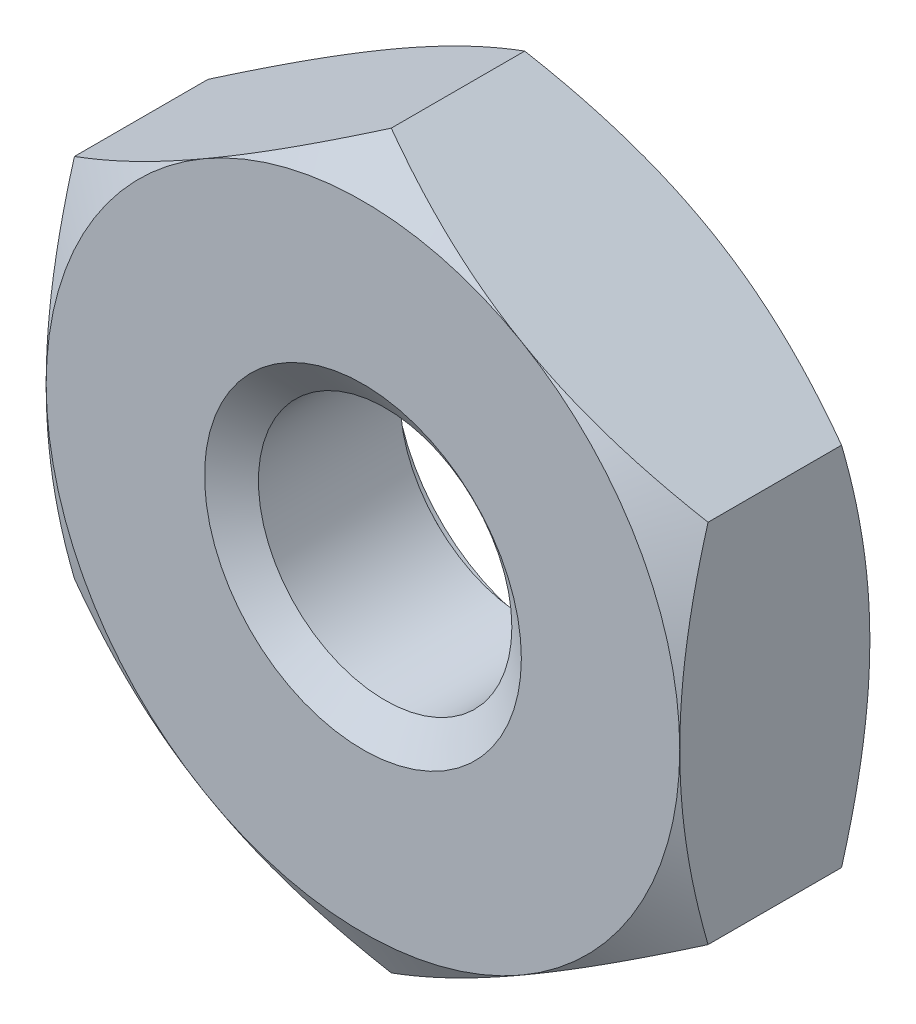
ISO-10303-21;
HEADER;
FILE_DESCRIPTION(('STEP AP214'),'2;1');
FILE_NAME('part.step','',(''),(''),'','','');
FILE_SCHEMA(('AUTOMOTIVE_DESIGN { 1 0 10303 214 1 1 1 1 }'));
ENDSEC;
DATA;
#1=APPLICATION_CONTEXT('core data for automotive mechanical design processes');
#2=APPLICATION_PROTOCOL_DEFINITION('international standard','automotive_design',2000,#1);
#3=PRODUCT_CONTEXT('',#1,'mechanical');
#4=PRODUCT('Part','Part','',(#3));
#5=PRODUCT_RELATED_PRODUCT_CATEGORY('part','',(#4));
#6=PRODUCT_DEFINITION_FORMATION('','',#4);
#7=PRODUCT_DEFINITION_CONTEXT('part definition',#1,'design');
#8=PRODUCT_DEFINITION('design','',#6,#7);
#9=PRODUCT_DEFINITION_SHAPE('','',#8);
#10=(LENGTH_UNIT() NAMED_UNIT(*) SI_UNIT(.MILLI.,.METRE.));
#11=(NAMED_UNIT(*) PLANE_ANGLE_UNIT() SI_UNIT($,.RADIAN.));
#12=(NAMED_UNIT(*) SI_UNIT($,.STERADIAN.) SOLID_ANGLE_UNIT());
#13=UNCERTAINTY_MEASURE_WITH_UNIT(LENGTH_MEASURE(1.E-05),#10,'distance_accuracy_value','');
#14=(GEOMETRIC_REPRESENTATION_CONTEXT(3) GLOBAL_UNCERTAINTY_ASSIGNED_CONTEXT((#13)) GLOBAL_UNIT_ASSIGNED_CONTEXT((#10,
#11,#12)) REPRESENTATION_CONTEXT('',''));
#15=CARTESIAN_POINT('',(0.,0.,0.));
#16=DIRECTION('',(0.,0.,1.));
#17=DIRECTION('',(1.,0.,0.));
#18=AXIS2_PLACEMENT_3D('',#15,#16,#17);
#19=CARTESIAN_POINT('',(0.,0.,-1.2));
#20=DIRECTION('',(0.,0.,1.));
#21=DIRECTION('',(1.,0.,0.));
#22=AXIS2_PLACEMENT_3D('',#19,#20,#21);
#23=CYLINDRICAL_SURFACE('',#22,0.8);
#24=CARTESIAN_POINT('',(0.,0.,-0.140041507641943));
#25=DIRECTION('',(0.,0.,1.));
#26=DIRECTION('',(1.,0.,0.));
#27=AXIS2_PLACEMENT_3D('',#24,#25,#26);
#28=CIRCLE('',#27,0.8);
#29=CARTESIAN_POINT('',(0.8,0.,-0.140041507641943));
#30=VERTEX_POINT('',#29);
#31=EDGE_CURVE('E175',#30,#30,#28,.F.);
#32=ORIENTED_EDGE('',*,*,#31,.F.);
#33=EDGE_LOOP('',(#32));
#34=FACE_BOUND('',#33,.T.);
#35=CARTESIAN_POINT('',(0.,0.,-1.03455849235806));
#36=DIRECTION('',(0.,0.,-1.));
#37=DIRECTION('',(-1.,0.,0.));
#38=AXIS2_PLACEMENT_3D('',#35,#36,#37);
#39=CIRCLE('',#38,0.8);
#40=CARTESIAN_POINT('',(-0.8,0.,-1.03455849235806));
#41=VERTEX_POINT('',#40);
#42=EDGE_CURVE('E40',#41,#41,#39,.F.);
#43=ORIENTED_EDGE('',*,*,#42,.F.);
#44=EDGE_LOOP('',(#43));
#45=FACE_BOUND('',#44,.T.);
#46=ADVANCED_FACE('F35',(#34,#45),#23,.F.);
#47=CARTESIAN_POINT('',(0.,2.3094010767585,-1.2));
#48=DIRECTION('',(-0.5,0.866025403784438,0.));
#49=DIRECTION('',(-0.866025403784438,-0.500000000000001,0.));
#50=AXIS2_PLACEMENT_3D('',#47,#48,#49);
#51=PLANE('',#50);
#52=DIRECTION('',(0.,0.,1.));
#53=VECTOR('',#52,1.);
#54=CARTESIAN_POINT('',(-2.,1.15470053837925,-1.2));
#55=LINE('',#54,#53);
#56=CARTESIAN_POINT('',(-2.,1.15470053837925,-1.02136720504592));
#57=VERTEX_POINT('',#56);
#58=CARTESIAN_POINT('',(-2.,1.15470053837925,-0.178632794954082));
#59=VERTEX_POINT('',#58);
#60=EDGE_CURVE('E165',#57,#59,#55,.T.);
#61=ORIENTED_EDGE('',*,*,#60,.T.);
#62=CARTESIAN_POINT('',(-2.0002,1.15458506832541,-0.178699466620499));
#63=CARTESIAN_POINT('',(-1.91230873709994,1.20532911262018,-0.14938953610068));
#64=CARTESIAN_POINT('',(-1.82365880552641,1.2565111744778,-0.122732851980468));
#65=CARTESIAN_POINT('',(-1.6448237530022,1.35976164019319,-0.0762024910207216));
#66=CARTESIAN_POINT('',(-1.55463545349496,1.41183187919145,-0.0563452763827796));
#67=CARTESIAN_POINT('',(-1.37537661423669,1.51532701829183,-0.0254334640232529));
#68=CARTESIAN_POINT('',(-1.2863336617737,1.56673599086578,-0.0141731515985315));
#69=CARTESIAN_POINT('',(-1.10782860221496,1.66979593505373,-0.000728662594642205));
#70=CARTESIAN_POINT('',(-1.01836714429604,1.72144653186531,0.00146664504653155));
#71=CARTESIAN_POINT('',(-0.851191646451202,1.81796535054794,-0.00309098933064922));
#72=CARTESIAN_POINT('',(-0.773452629734216,1.86284799277603,-0.00872487468701521));
#73=CARTESIAN_POINT('',(-0.618481085463867,1.95232085557725,-0.0265838952608293));
#74=CARTESIAN_POINT('',(-0.541249094258801,1.99691076648954,-0.0388151360234403));
#75=CARTESIAN_POINT('',(-0.385957813517799,2.08656822922816,-0.069393436867611));
#76=CARTESIAN_POINT('',(-0.30791818689262,2.13162442866767,-0.0878701670657172));
#77=CARTESIAN_POINT('',(-0.153003134307865,2.221064675979,-0.129805518212858));
#78=CARTESIAN_POINT('',(-0.0761257223768793,2.26544987045196,-0.153254280492316));
#79=CARTESIAN_POINT('',(0.000200000000000681,2.30951654681234,-0.1786994666205));
#80=B_SPLINE_CURVE_WITH_KNOTS('',3,(#62,#63,#64,#65,#66,#67,#68,#69,#70,#71,#72,#73,#74,#75,#76,
#77,#78,#79),.UNSPECIFIED.,.F.,.F.,(4,2,2,2,2,2,2,2,4),(0.,0.31703182469561,0.634825876346564,
0.944753967652636,1.25430138000371,1.52387047293094,1.79368946861028,2.06949491027634,
2.34475850821473),.UNSPECIFIED.);
#81=CARTESIAN_POINT('',(-1.,1.73205080756888,0.));
#82=VERTEX_POINT('',#81);
#83=EDGE_CURVE('E134',#59,#82,#80,.T.);
#84=ORIENTED_EDGE('',*,*,#83,.T.);
#85=CARTESIAN_POINT('',(0.,2.3094010767585,-0.178632794954083));
#86=VERTEX_POINT('',#85);
#87=EDGE_CURVE('E54',#82,#86,#80,.T.);
#88=ORIENTED_EDGE('',*,*,#87,.T.);
#89=DIRECTION('',(0.,0.,1.));
#90=VECTOR('',#89,1.);
#91=CARTESIAN_POINT('',(0.,2.3094010767585,-1.2));
#92=LINE('',#91,#90);
#93=CARTESIAN_POINT('',(0.,2.3094010767585,-1.02136720504592));
#94=VERTEX_POINT('',#93);
#95=EDGE_CURVE('E150',#94,#86,#92,.T.);
#96=ORIENTED_EDGE('',*,*,#95,.F.);
#97=CARTESIAN_POINT('',(-2.0002,1.15458506832541,-1.0213005333795));
#98=CARTESIAN_POINT('',(-1.91230873709994,1.20532911262018,-1.05061046389932));
#99=CARTESIAN_POINT('',(-1.82365880552641,1.2565111744778,-1.07726714801953));
#100=CARTESIAN_POINT('',(-1.6448237530022,1.35976164019319,-1.12379750897928));
#101=CARTESIAN_POINT('',(-1.55463545349496,1.41183187919145,-1.14365472361722));
#102=CARTESIAN_POINT('',(-1.37537661423669,1.51532701829183,-1.17456653597675));
#103=CARTESIAN_POINT('',(-1.2863336617737,1.56673599086578,-1.18582684840147));
#104=CARTESIAN_POINT('',(-1.10782860221496,1.66979593505373,-1.19927133740536));
#105=CARTESIAN_POINT('',(-1.01836714429604,1.72144653186531,-1.20146664504653));
#106=CARTESIAN_POINT('',(-0.851191646451202,1.81796535054794,-1.19690901066935));
#107=CARTESIAN_POINT('',(-0.773452629734216,1.86284799277603,-1.19127512531298));
#108=CARTESIAN_POINT('',(-0.618481085463866,1.95232085557725,-1.17341610473917));
#109=CARTESIAN_POINT('',(-0.541249094258801,1.99691076648954,-1.16118486397656));
#110=CARTESIAN_POINT('',(-0.385957813517799,2.08656822922816,-1.13060656313239));
#111=CARTESIAN_POINT('',(-0.30791818689262,2.13162442866767,-1.11212983293428));
#112=CARTESIAN_POINT('',(-0.153003134307865,2.221064675979,-1.07019448178714));
#113=CARTESIAN_POINT('',(-0.0761257223768793,2.26544987045196,-1.04674571950768));
#114=CARTESIAN_POINT('',(0.000200000000000687,2.30951654681234,-1.0213005333795));
#115=B_SPLINE_CURVE_WITH_KNOTS('',3,(#97,#98,#99,#100,#101,#102,#103,#104,#105,#106,#107,#108,
#109,#110,#111,#112,#113,#114),.UNSPECIFIED.,.F.,.F.,(4,2,2,2,2,2,2,2,4),(0.,0.31703182469561,
0.634825876346564,0.944753967652636,1.25430138000371,1.52387047293094,1.79368946861028,
2.06949491027634,2.34475850821473),.UNSPECIFIED.);
#116=CARTESIAN_POINT('',(-1.,1.73205080756888,-1.2));
#117=VERTEX_POINT('',#116);
#118=EDGE_CURVE('E168',#117,#94,#115,.T.);
#119=ORIENTED_EDGE('',*,*,#118,.F.);
#120=EDGE_CURVE('E267',#57,#117,#115,.T.);
#121=ORIENTED_EDGE('',*,*,#120,.F.);
#122=EDGE_LOOP('',(#61,#84,#88,#96,#119,#121));
#123=FACE_BOUND('',#122,.T.);
#124=ADVANCED_FACE('F37',(#123),#51,.T.);
#125=CARTESIAN_POINT('',(2.,1.15470053837925,-1.2));
#126=DIRECTION('',(0.500000000000001,0.866025403784438,0.));
#127=DIRECTION('',(-0.866025403784438,0.500000000000001,0.));
#128=AXIS2_PLACEMENT_3D('',#125,#126,#127);
#129=PLANE('',#128);
#130=ORIENTED_EDGE('',*,*,#95,.T.);
#131=CARTESIAN_POINT('',(-0.000199999999999642,2.30951654681234,-0.1786994666205));
#132=CARTESIAN_POINT('',(0.0876912629000606,2.25877250251758,-0.149389536100681));
#133=CARTESIAN_POINT('',(0.176341194473592,2.20759044065996,-0.122732851980469));
#134=CARTESIAN_POINT('',(0.355176246997803,2.10433997494456,-0.0762024910207223));
#135=CARTESIAN_POINT('',(0.445364546505037,2.05226973594631,-0.05634527638278));
#136=CARTESIAN_POINT('',(0.624623385763307,1.94877459684592,-0.025433464023253));
#137=CARTESIAN_POINT('',(0.713666338226305,1.89736562427197,-0.0141731515985316));
#138=CARTESIAN_POINT('',(0.892171397785044,1.79430568008402,-0.000728662594642256));
#139=CARTESIAN_POINT('',(0.981632855703959,1.74265508327244,0.00146664504653147));
#140=CARTESIAN_POINT('',(1.1488083535488,1.64613626458981,-0.00309098933064909));
#141=CARTESIAN_POINT('',(1.22654737026578,1.60125362236172,-0.00872487468701486));
#142=CARTESIAN_POINT('',(1.38151891453613,1.51178075956051,-0.0265838952608287));
#143=CARTESIAN_POINT('',(1.4587509057412,1.46719084864821,-0.0388151360234397));
#144=CARTESIAN_POINT('',(1.6140421864822,1.37753338590959,-0.0693934368676103));
#145=CARTESIAN_POINT('',(1.69208181310738,1.33247718647009,-0.0878701670657164));
#146=CARTESIAN_POINT('',(1.84699686569213,1.24303693915875,-0.129805518212856));
#147=CARTESIAN_POINT('',(1.92387427762312,1.1986517446858,-0.153254280492314));
#148=CARTESIAN_POINT('',(2.0002,1.15458506832541,-0.178699466620499));
#149=B_SPLINE_CURVE_WITH_KNOTS('',3,(#131,#132,#133,#134,#135,#136,#137,#138,#139,#140,#141,
#142,#143,#144,#145,#146,#147,#148),.UNSPECIFIED.,.F.,.F.,(4,2,2,2,2,2,2,2,4),(0.,
0.31703182469561,0.634825876346564,0.944753967652637,1.25430138000371,1.52387047293094,
1.79368946861028,2.06949491027634,2.34475850821472),.UNSPECIFIED.);
#150=CARTESIAN_POINT('',(1.,1.73205080756888,0.));
#151=VERTEX_POINT('',#150);
#152=EDGE_CURVE('E144',#86,#151,#149,.T.);
#153=ORIENTED_EDGE('',*,*,#152,.T.);
#154=CARTESIAN_POINT('',(2.,1.15470053837925,-0.178632794954083));
#155=VERTEX_POINT('',#154);
#156=EDGE_CURVE('E61',#151,#155,#149,.T.);
#157=ORIENTED_EDGE('',*,*,#156,.T.);
#158=DIRECTION('',(0.,0.,1.));
#159=VECTOR('',#158,1.);
#160=CARTESIAN_POINT('',(2.,1.15470053837925,-1.2));
#161=LINE('',#160,#159);
#162=CARTESIAN_POINT('',(2.,1.15470053837925,-1.02136720504592));
#163=VERTEX_POINT('',#162);
#164=EDGE_CURVE('E143',#163,#155,#161,.T.);
#165=ORIENTED_EDGE('',*,*,#164,.F.);
#166=CARTESIAN_POINT('',(-0.000199999999999642,2.30951654681234,-1.0213005333795));
#167=CARTESIAN_POINT('',(0.0876912629000602,2.25877250251758,-1.05061046389932));
#168=CARTESIAN_POINT('',(0.176341194473592,2.20759044065996,-1.07726714801953));
#169=CARTESIAN_POINT('',(0.355176246997803,2.10433997494456,-1.12379750897928));
#170=CARTESIAN_POINT('',(0.445364546505037,2.05226973594631,-1.14365472361722));
#171=CARTESIAN_POINT('',(0.624623385763307,1.94877459684592,-1.17456653597675));
#172=CARTESIAN_POINT('',(0.713666338226305,1.89736562427197,-1.18582684840147));
#173=CARTESIAN_POINT('',(0.892171397785044,1.79430568008402,-1.19927133740536));
#174=CARTESIAN_POINT('',(0.981632855703959,1.74265508327244,-1.20146664504653));
#175=CARTESIAN_POINT('',(1.1488083535488,1.64613626458981,-1.19690901066935));
#176=CARTESIAN_POINT('',(1.22654737026578,1.60125362236172,-1.19127512531298));
#177=CARTESIAN_POINT('',(1.38151891453613,1.51178075956051,-1.17341610473917));
#178=CARTESIAN_POINT('',(1.4587509057412,1.46719084864821,-1.16118486397656));
#179=CARTESIAN_POINT('',(1.6140421864822,1.37753338590959,-1.13060656313239));
#180=CARTESIAN_POINT('',(1.69208181310738,1.33247718647009,-1.11212983293428));
#181=CARTESIAN_POINT('',(1.84699686569213,1.24303693915875,-1.07019448178714));
#182=CARTESIAN_POINT('',(1.92387427762312,1.1986517446858,-1.04674571950769));
#183=CARTESIAN_POINT('',(2.0002,1.15458506832541,-1.0213005333795));
#184=B_SPLINE_CURVE_WITH_KNOTS('',3,(#166,#167,#168,#169,#170,#171,#172,#173,#174,#175,#176,
#177,#178,#179,#180,#181,#182,#183),.UNSPECIFIED.,.F.,.F.,(4,2,2,2,2,2,2,2,4),(0.,
0.317031824695611,0.634825876346565,0.944753967652637,1.25430138000371,1.52387047293094,
1.79368946861028,2.06949491027634,2.34475850821473),.UNSPECIFIED.);
#185=CARTESIAN_POINT('',(1.,1.73205080756888,-1.2));
#186=VERTEX_POINT('',#185);
#187=EDGE_CURVE('E260',#186,#163,#184,.T.);
#188=ORIENTED_EDGE('',*,*,#187,.F.);
#189=EDGE_CURVE('E266',#94,#186,#184,.T.);
#190=ORIENTED_EDGE('',*,*,#189,.F.);
#191=EDGE_LOOP('',(#130,#153,#157,#165,#188,#190));
#192=FACE_BOUND('',#191,.T.);
#193=ADVANCED_FACE('F141',(#192),#129,.T.);
#194=CARTESIAN_POINT('',(2.,1.15470053837925,-1.2));
#195=DIRECTION('',(-1.,0.,0.));
#196=DIRECTION('',(0.,0.,1.));
#197=AXIS2_PLACEMENT_3D('',#194,#195,#196);
#198=PLANE('',#197);
#199=CARTESIAN_POINT('',(2.,-3.06243599497946,-0.957053410620322));
#200=CARTESIAN_POINT('',(2.,-2.97462468513202,-0.914618135332453));
#201=CARTESIAN_POINT('',(2.,-2.88660576044574,-0.872604701878199));
#202=CARTESIAN_POINT('',(2.,-2.71004042392046,-0.789662573424089));
#203=CARTESIAN_POINT('',(2.,-2.62149392396102,-0.748734066234633));
#204=CARTESIAN_POINT('',(2.,-2.44328285836993,-0.667987231477972));
#205=CARTESIAN_POINT('',(2.,-2.3536147942302,-0.628176597351501));
#206=CARTESIAN_POINT('',(2.,-2.17354167395292,-0.55026529289016));
#207=CARTESIAN_POINT('',(2.,-2.08313665652235,-0.512164533422732));
#208=CARTESIAN_POINT('',(2.,-1.90031404940485,-0.437671460362099));
#209=CARTESIAN_POINT('',(2.,-1.80788540023433,-0.401306140224328));
#210=CARTESIAN_POINT('',(2.,-1.62195694964761,-0.331431205515075));
#211=CARTESIAN_POINT('',(2.,-1.52845725096658,-0.297921319609402));
#212=CARTESIAN_POINT('',(2.,-1.34040158791134,-0.234645877627143));
#213=CARTESIAN_POINT('',(2.,-1.24584820361334,-0.204872731943686));
#214=CARTESIAN_POINT('',(2.,-1.05539728812543,-0.150041663725098));
#215=CARTESIAN_POINT('',(2.,-0.959500192348563,-0.124982250068513));
#216=CARTESIAN_POINT('',(2.,-0.766296107056175,-0.0807954522614518));
#217=CARTESIAN_POINT('',(2.,-0.668988749343052,-0.0616696475902393));
#218=CARTESIAN_POINT('',(2.,-0.47320157375166,-0.0306369133490218));
#219=CARTESIAN_POINT('',(2.,-0.374721754836867,-0.0187299901614154));
#220=CARTESIAN_POINT('',(2.,-0.177725213014457,-0.00319166535968511));
#221=CARTESIAN_POINT('',(2.,-0.0792127464695941,0.000492126942978446));
#222=CARTESIAN_POINT('',(2.,0.117733134481545,-0.000599210482845911));
#223=CARTESIAN_POINT('',(2.,0.216166562771044,-0.00537214444611042));
#224=CARTESIAN_POINT('',(2.,0.454297223248125,-0.0267243139120267));
#225=CARTESIAN_POINT('',(2.,0.593620477818539,-0.0474829418890646));
#226=CARTESIAN_POINT('',(2.,0.869689306254772,-0.102199494270679));
#227=CARTESIAN_POINT('',(2.,1.00643164818022,-0.136172948124204));
#228=CARTESIAN_POINT('',(2.,1.21108706615394,-0.194758945655362));
#229=CARTESIAN_POINT('',(2.,1.28004655189501,-0.215857177032567));
#230=CARTESIAN_POINT('',(2.,1.41724192464572,-0.260142084128329));
#231=CARTESIAN_POINT('',(2.,1.48547827495749,-0.283327319381158));
#232=CARTESIAN_POINT('',(2.,1.62094688255353,-0.33130290797197));
#233=CARTESIAN_POINT('',(2.,1.68818262968755,-0.356083492073603));
#234=CARTESIAN_POINT('',(2.,1.82213246587635,-0.407099147686617));
#235=CARTESIAN_POINT('',(2.,1.88884633148565,-0.433334807052328));
#236=CARTESIAN_POINT('',(2.,1.95531849493342,-0.460154503270897));
#237=B_SPLINE_CURVE_WITH_KNOTS('',3,(#199,#200,#201,#202,#203,#204,#205,#206,#207,#208,#209,
#210,#211,#212,#213,#214,#215,#216,#217,#218,#219,#220,#221,#222,#223,#224,#225,#226,#227,#228,
#229,#230,#231,#232,#233,#234,#235,#236),.UNSPECIFIED.,.F.,.F.,(4,2,2,2,2,2,2,2,2,2,2,2,2,2,2,2,
2,2,4),(0.,0.292585896266135,0.585222115299634,0.879532973229948,1.17382847142413,
1.47176772581358,1.76967863724007,2.06697432467463,2.36417580814398,2.66145633652585,
2.95873712774069,3.25411843045681,3.54942304948606,3.97114178181684,4.39335760296179,
4.60967655565109,4.82584733174413,5.04080135347749,5.25584285892498),.UNSPECIFIED.);
#238=CARTESIAN_POINT('',(2.,-1.15470053837926,-0.178632794954083));
#239=VERTEX_POINT('',#238);
#240=CARTESIAN_POINT('',(2.,0.,0.));
#241=VERTEX_POINT('',#240);
#242=EDGE_CURVE('E136',#239,#241,#237,.T.);
#243=ORIENTED_EDGE('',*,*,#242,.F.);
#244=DIRECTION('',(0.,0.,1.));
#245=VECTOR('',#244,1.);
#246=CARTESIAN_POINT('',(2.,-1.15470053837925,-1.2));
#247=LINE('',#246,#245);
#248=CARTESIAN_POINT('',(2.,-1.15470053837926,-1.02136720504592));
#249=VERTEX_POINT('',#248);
#250=EDGE_CURVE('E151',#249,#239,#247,.T.);
#251=ORIENTED_EDGE('',*,*,#250,.F.);
#252=CARTESIAN_POINT('',(2.,-3.06243599497946,-0.242946589379678));
#253=CARTESIAN_POINT('',(2.,-2.97462468513202,-0.285381864667547));
#254=CARTESIAN_POINT('',(2.,-2.88660576044574,-0.327395298121801));
#255=CARTESIAN_POINT('',(2.,-2.71004042392046,-0.410337426575911));
#256=CARTESIAN_POINT('',(2.,-2.62149392396102,-0.451265933765367));
#257=CARTESIAN_POINT('',(2.,-2.44328285836993,-0.532012768522028));
#258=CARTESIAN_POINT('',(2.,-2.3536147942302,-0.571823402648499));
#259=CARTESIAN_POINT('',(2.,-2.17354167395292,-0.64973470710984));
#260=CARTESIAN_POINT('',(2.,-2.08313665652235,-0.687835466577268));
#261=CARTESIAN_POINT('',(2.,-1.90031404940485,-0.762328539637901));
#262=CARTESIAN_POINT('',(2.,-1.80788540023433,-0.798693859775672));
#263=CARTESIAN_POINT('',(2.,-1.62195694964761,-0.868568794484925));
#264=CARTESIAN_POINT('',(2.,-1.52845725096658,-0.902078680390598));
#265=CARTESIAN_POINT('',(2.,-1.34040158791134,-0.965354122372857));
#266=CARTESIAN_POINT('',(2.,-1.24584820361334,-0.995127268056314));
#267=CARTESIAN_POINT('',(2.,-1.05539728812543,-1.0499583362749));
#268=CARTESIAN_POINT('',(2.,-0.959500192348563,-1.07501774993149));
#269=CARTESIAN_POINT('',(2.,-0.766296107056176,-1.11920454773855));
#270=CARTESIAN_POINT('',(2.,-0.668988749343052,-1.13833035240976));
#271=CARTESIAN_POINT('',(2.,-0.47320157375166,-1.16936308665098));
#272=CARTESIAN_POINT('',(2.,-0.374721754836867,-1.18127000983858));
#273=CARTESIAN_POINT('',(2.,-0.177725213014457,-1.19680833464031));
#274=CARTESIAN_POINT('',(2.,-0.0792127464695941,-1.20049212694298));
#275=CARTESIAN_POINT('',(2.,0.117733134481545,-1.19940078951715));
#276=CARTESIAN_POINT('',(2.,0.216166562771044,-1.19462785555389));
#277=CARTESIAN_POINT('',(2.,0.454297223248125,-1.17327568608797));
#278=CARTESIAN_POINT('',(2.,0.593620477818539,-1.15251705811094));
#279=CARTESIAN_POINT('',(2.,0.869689306254772,-1.09780050572932));
#280=CARTESIAN_POINT('',(2.,1.00643164818022,-1.0638270518758));
#281=CARTESIAN_POINT('',(2.,1.21108706615394,-1.00524105434464));
#282=CARTESIAN_POINT('',(2.,1.28004655189501,-0.984142822967433));
#283=CARTESIAN_POINT('',(2.,1.41724192464572,-0.939857915871671));
#284=CARTESIAN_POINT('',(2.,1.48547827495749,-0.916672680618842));
#285=CARTESIAN_POINT('',(2.,1.62094688255353,-0.86869709202803));
#286=CARTESIAN_POINT('',(2.,1.68818262968755,-0.843916507926397));
#287=CARTESIAN_POINT('',(2.,1.82213246587635,-0.792900852313383));
#288=CARTESIAN_POINT('',(2.,1.88884633148565,-0.766665192947672));
#289=CARTESIAN_POINT('',(2.,1.95531849493342,-0.739845496729103));
#290=B_SPLINE_CURVE_WITH_KNOTS('',3,(#252,#253,#254,#255,#256,#257,#258,#259,#260,#261,#262,
#263,#264,#265,#266,#267,#268,#269,#270,#271,#272,#273,#274,#275,#276,#277,#278,#279,#280,#281,
#282,#283,#284,#285,#286,#287,#288,#289),.UNSPECIFIED.,.F.,.F.,(4,2,2,2,2,2,2,2,2,2,2,2,2,2,2,2,
2,2,4),(0.,0.292585896266135,0.585222115299634,0.879532973229948,1.17382847142413,
1.47176772581358,1.76967863724007,2.06697432467463,2.36417580814398,2.66145633652585,
2.95873712774069,3.25411843045681,3.54942304948606,3.97114178181684,4.39335760296179,
4.60967655565109,4.82584733174413,5.04080135347749,5.25584285892498),.UNSPECIFIED.);
#291=CARTESIAN_POINT('',(2.,0.,-1.2));
#292=VERTEX_POINT('',#291);
#293=EDGE_CURVE('E274',#249,#292,#290,.T.);
#294=ORIENTED_EDGE('',*,*,#293,.T.);
#295=EDGE_CURVE('E149',#292,#163,#290,.T.);
#296=ORIENTED_EDGE('',*,*,#295,.T.);
#297=ORIENTED_EDGE('',*,*,#164,.T.);
#298=EDGE_CURVE('E126',#241,#155,#237,.T.);
#299=ORIENTED_EDGE('',*,*,#298,.F.);
#300=EDGE_LOOP('',(#243,#251,#294,#296,#297,#299));
#301=FACE_BOUND('',#300,.T.);
#302=ADVANCED_FACE('F147',(#301),#198,.F.);
#303=CARTESIAN_POINT('',(0.,-2.30940107675851,-1.2));
#304=DIRECTION('',(0.5,-0.866025403784438,0.));
#305=DIRECTION('',(0.866025403784439,0.5,0.));
#306=AXIS2_PLACEMENT_3D('',#303,#304,#305);
#307=PLANE('',#306);
#308=ORIENTED_EDGE('',*,*,#250,.T.);
#309=CARTESIAN_POINT('',(2.0002,-1.15458506832542,-0.1786994666205));
#310=CARTESIAN_POINT('',(1.91230873709994,-1.20532911262018,-0.149389536100681));
#311=CARTESIAN_POINT('',(1.82365880552641,-1.2565111744778,-0.122732851980469));
#312=CARTESIAN_POINT('',(1.6448237530022,-1.3597616401932,-0.0762024910207228));
#313=CARTESIAN_POINT('',(1.55463545349496,-1.41183187919145,-0.0563452763827807));
#314=CARTESIAN_POINT('',(1.37537661423669,-1.51532701829184,-0.0254334640232539));
#315=CARTESIAN_POINT('',(1.2863336617737,-1.56673599086579,-0.0141731515985327));
#316=CARTESIAN_POINT('',(1.10782860221496,-1.66979593505373,-0.000728662594643546));
#317=CARTESIAN_POINT('',(1.01836714429604,-1.72144653186532,0.00146664504653015));
#318=CARTESIAN_POINT('',(0.851191646451201,-1.81796535054794,-0.00309098933065068));
#319=CARTESIAN_POINT('',(0.773452629734215,-1.86284799277603,-0.00872487468701665));
#320=CARTESIAN_POINT('',(0.618481085463866,-1.95232085557725,-0.0265838952608308));
#321=CARTESIAN_POINT('',(0.541249094258801,-1.99691076648955,-0.0388151360234419));
#322=CARTESIAN_POINT('',(0.385957813517798,-2.08656822922817,-0.0693934368676126));
#323=CARTESIAN_POINT('',(0.30791818689262,-2.13162442866767,-0.0878701670657187));
#324=CARTESIAN_POINT('',(0.153003134307865,-2.221064675979,-0.129805518212859));
#325=CARTESIAN_POINT('',(0.0761257223768798,-2.26544987045196,-0.153254280492317));
#326=CARTESIAN_POINT('',(-0.000200000000000184,-2.30951654681234,-0.178699466620501));
#327=B_SPLINE_CURVE_WITH_KNOTS('',3,(#309,#310,#311,#312,#313,#314,#315,#316,#317,#318,#319,
#320,#321,#322,#323,#324,#325,#326),.UNSPECIFIED.,.F.,.F.,(4,2,2,2,2,2,2,2,4),(0.,
0.31703182469561,0.634825876346564,0.944753967652637,1.25430138000371,1.52387047293094,
1.79368946861028,2.06949491027634,2.34475850821472),.UNSPECIFIED.);
#328=CARTESIAN_POINT('',(1.,-1.73205080756888,0.));
#329=VERTEX_POINT('',#328);
#330=EDGE_CURVE('E372',#239,#329,#327,.T.);
#331=ORIENTED_EDGE('',*,*,#330,.T.);
#332=CARTESIAN_POINT('',(0.,-2.3094010767585,-0.178632794954083));
#333=VERTEX_POINT('',#332);
#334=EDGE_CURVE('E228',#329,#333,#327,.T.);
#335=ORIENTED_EDGE('',*,*,#334,.T.);
#336=DIRECTION('',(0.,0.,1.));
#337=VECTOR('',#336,1.);
#338=CARTESIAN_POINT('',(0.,-2.30940107675851,-1.2));
#339=LINE('',#338,#337);
#340=CARTESIAN_POINT('',(0.,-2.3094010767585,-1.02136720504592));
#341=VERTEX_POINT('',#340);
#342=EDGE_CURVE('E156',#341,#333,#339,.T.);
#343=ORIENTED_EDGE('',*,*,#342,.F.);
#344=CARTESIAN_POINT('',(2.0002,-1.15458506832542,-1.0213005333795));
#345=CARTESIAN_POINT('',(1.91230873709994,-1.20532911262018,-1.05061046389932));
#346=CARTESIAN_POINT('',(1.82365880552641,-1.2565111744778,-1.07726714801953));
#347=CARTESIAN_POINT('',(1.6448237530022,-1.3597616401932,-1.12379750897928));
#348=CARTESIAN_POINT('',(1.55463545349496,-1.41183187919145,-1.14365472361722));
#349=CARTESIAN_POINT('',(1.37537661423669,-1.51532701829184,-1.17456653597675));
#350=CARTESIAN_POINT('',(1.2863336617737,-1.56673599086579,-1.18582684840147));
#351=CARTESIAN_POINT('',(1.10782860221496,-1.66979593505373,-1.19927133740536));
#352=CARTESIAN_POINT('',(1.01836714429604,-1.72144653186532,-1.20146664504653));
#353=CARTESIAN_POINT('',(0.851191646451201,-1.81796535054794,-1.19690901066935));
#354=CARTESIAN_POINT('',(0.773452629734215,-1.86284799277603,-1.19127512531298));
#355=CARTESIAN_POINT('',(0.618481085463866,-1.95232085557725,-1.17341610473917));
#356=CARTESIAN_POINT('',(0.541249094258801,-1.99691076648955,-1.16118486397656));
#357=CARTESIAN_POINT('',(0.385957813517798,-2.08656822922817,-1.13060656313239));
#358=CARTESIAN_POINT('',(0.30791818689262,-2.13162442866767,-1.11212983293428));
#359=CARTESIAN_POINT('',(0.153003134307865,-2.221064675979,-1.07019448178714));
#360=CARTESIAN_POINT('',(0.0761257223768796,-2.26544987045196,-1.04674571950768));
#361=CARTESIAN_POINT('',(-0.000200000000000184,-2.30951654681234,-1.0213005333795));
#362=B_SPLINE_CURVE_WITH_KNOTS('',3,(#344,#345,#346,#347,#348,#349,#350,#351,#352,#353,#354,
#355,#356,#357,#358,#359,#360,#361),.UNSPECIFIED.,.F.,.F.,(4,2,2,2,2,2,2,2,4),(0.,
0.31703182469561,0.634825876346564,0.944753967652637,1.25430138000371,1.52387047293094,
1.79368946861028,2.06949491027634,2.34475850821472),.UNSPECIFIED.);
#363=CARTESIAN_POINT('',(1.,-1.73205080756888,-1.2));
#364=VERTEX_POINT('',#363);
#365=EDGE_CURVE('E281',#364,#341,#362,.T.);
#366=ORIENTED_EDGE('',*,*,#365,.F.);
#367=EDGE_CURVE('E280',#249,#364,#362,.T.);
#368=ORIENTED_EDGE('',*,*,#367,.F.);
#369=EDGE_LOOP('',(#308,#331,#335,#343,#366,#368));
#370=FACE_BOUND('',#369,.T.);
#371=ADVANCED_FACE('F293',(#370),#307,.T.);
#372=CARTESIAN_POINT('',(-2.,-1.15470053837925,-1.2));
#373=DIRECTION('',(-0.500000000000001,-0.866025403784438,0.));
#374=DIRECTION('',(0.866025403784438,-0.500000000000001,0.));
#375=AXIS2_PLACEMENT_3D('',#372,#373,#374);
#376=PLANE('',#375);
#377=ORIENTED_EDGE('',*,*,#342,.T.);
#378=CARTESIAN_POINT('',(0.000199999999999694,-2.30951654681234,-0.178699466620501));
#379=CARTESIAN_POINT('',(-0.0876912629000605,-2.25877250251758,-0.149389536100682));
#380=CARTESIAN_POINT('',(-0.176341194473592,-2.20759044065996,-0.12273285198047));
#381=CARTESIAN_POINT('',(-0.355176246997803,-2.10433997494456,-0.0762024910207236));
#382=CARTESIAN_POINT('',(-0.445364546505038,-2.05226973594631,-0.0563452763827815));
#383=CARTESIAN_POINT('',(-0.624623385763307,-1.94877459684593,-0.0254334640232544));
#384=CARTESIAN_POINT('',(-0.713666338226305,-1.89736562427197,-0.0141731515985328));
#385=CARTESIAN_POINT('',(-0.892171397785045,-1.79430568008403,-0.00072866259464325));
#386=CARTESIAN_POINT('',(-0.98163285570396,-1.74265508327244,0.00146664504653053));
#387=CARTESIAN_POINT('',(-1.1488083535488,-1.64613626458982,-0.00309098933065013));
#388=CARTESIAN_POINT('',(-1.22654737026579,-1.60125362236173,-0.008724874687016));
#389=CARTESIAN_POINT('',(-1.38151891453613,-1.51178075956051,-0.0265838952608299));
#390=CARTESIAN_POINT('',(-1.4587509057412,-1.46719084864821,-0.038815136023441));
#391=CARTESIAN_POINT('',(-1.6140421864822,-1.37753338590959,-0.0693934368676115));
#392=CARTESIAN_POINT('',(-1.69208181310738,-1.33247718647009,-0.0878701670657176));
#393=CARTESIAN_POINT('',(-1.84699686569214,-1.24303693915876,-0.129805518212858));
#394=CARTESIAN_POINT('',(-1.92387427762312,-1.1986517446858,-0.153254280492315));
#395=CARTESIAN_POINT('',(-2.0002,-1.15458506832541,-0.1786994666205));
#396=B_SPLINE_CURVE_WITH_KNOTS('',3,(#378,#379,#380,#381,#382,#383,#384,#385,#386,#387,#388,
#389,#390,#391,#392,#393,#394,#395),.UNSPECIFIED.,.F.,.F.,(4,2,2,2,2,2,2,2,4),(0.,
0.317031824695611,0.634825876346565,0.944753967652638,1.25430138000372,1.52387047293094,
1.79368946861028,2.06949491027634,2.34475850821473),.UNSPECIFIED.);
#397=CARTESIAN_POINT('',(-1.,-1.73205080756888,0.));
#398=VERTEX_POINT('',#397);
#399=EDGE_CURVE('E369',#333,#398,#396,.T.);
#400=ORIENTED_EDGE('',*,*,#399,.T.);
#401=CARTESIAN_POINT('',(-2.,-1.15470053837925,-0.178632794954083));
#402=VERTEX_POINT('',#401);
#403=EDGE_CURVE('E201',#398,#402,#396,.T.);
#404=ORIENTED_EDGE('',*,*,#403,.T.);
#405=DIRECTION('',(0.,0.,1.));
#406=VECTOR('',#405,1.);
#407=CARTESIAN_POINT('',(-2.,-1.15470053837925,-1.2));
#408=LINE('',#407,#406);
#409=CARTESIAN_POINT('',(-2.,-1.15470053837925,-1.02136720504592));
#410=VERTEX_POINT('',#409);
#411=EDGE_CURVE('E162',#410,#402,#408,.T.);
#412=ORIENTED_EDGE('',*,*,#411,.F.);
#413=CARTESIAN_POINT('',(0.000199999999999687,-2.30951654681234,-1.0213005333795));
#414=CARTESIAN_POINT('',(-0.0876912629000604,-2.25877250251758,-1.05061046389932));
#415=CARTESIAN_POINT('',(-0.176341194473592,-2.20759044065996,-1.07726714801953));
#416=CARTESIAN_POINT('',(-0.355176246997803,-2.10433997494456,-1.12379750897928));
#417=CARTESIAN_POINT('',(-0.445364546505037,-2.05226973594631,-1.14365472361722));
#418=CARTESIAN_POINT('',(-0.624623385763307,-1.94877459684593,-1.17456653597675));
#419=CARTESIAN_POINT('',(-0.713666338226305,-1.89736562427197,-1.18582684840147));
#420=CARTESIAN_POINT('',(-0.892171397785045,-1.79430568008403,-1.19927133740536));
#421=CARTESIAN_POINT('',(-0.98163285570396,-1.74265508327244,-1.20146664504653));
#422=CARTESIAN_POINT('',(-1.1488083535488,-1.64613626458982,-1.19690901066935));
#423=CARTESIAN_POINT('',(-1.22654737026579,-1.60125362236173,-1.19127512531298));
#424=CARTESIAN_POINT('',(-1.38151891453613,-1.51178075956051,-1.17341610473917));
#425=CARTESIAN_POINT('',(-1.4587509057412,-1.46719084864821,-1.16118486397656));
#426=CARTESIAN_POINT('',(-1.6140421864822,-1.37753338590959,-1.13060656313239));
#427=CARTESIAN_POINT('',(-1.69208181310738,-1.33247718647009,-1.11212983293428));
#428=CARTESIAN_POINT('',(-1.84699686569214,-1.24303693915876,-1.07019448178714));
#429=CARTESIAN_POINT('',(-1.92387427762312,-1.1986517446858,-1.04674571950768));
#430=CARTESIAN_POINT('',(-2.0002,-1.15458506832541,-1.0213005333795));
#431=B_SPLINE_CURVE_WITH_KNOTS('',3,(#413,#414,#415,#416,#417,#418,#419,#420,#421,#422,#423,
#424,#425,#426,#427,#428,#429,#430),.UNSPECIFIED.,.F.,.F.,(4,2,2,2,2,2,2,2,4),(0.,
0.317031824695611,0.634825876346565,0.944753967652638,1.25430138000372,1.52387047293094,
1.79368946861029,2.06949491027634,2.34475850821473),.UNSPECIFIED.);
#432=CARTESIAN_POINT('',(-1.,-1.73205080756888,-1.2));
#433=VERTEX_POINT('',#432);
#434=EDGE_CURVE('E288',#433,#410,#431,.T.);
#435=ORIENTED_EDGE('',*,*,#434,.F.);
#436=EDGE_CURVE('E287',#341,#433,#431,.T.);
#437=ORIENTED_EDGE('',*,*,#436,.F.);
#438=EDGE_LOOP('',(#377,#400,#404,#412,#435,#437));
#439=FACE_BOUND('',#438,.T.);
#440=ADVANCED_FACE('F296',(#439),#376,.T.);
#441=CARTESIAN_POINT('',(-2.,1.15470053837925,-1.2));
#442=DIRECTION('',(-1.,0.,0.));
#443=DIRECTION('',(0.,0.,1.));
#444=AXIS2_PLACEMENT_3D('',#441,#442,#443);
#445=PLANE('',#444);
#446=ORIENTED_EDGE('',*,*,#411,.T.);
#447=CARTESIAN_POINT('',(-2.,-3.06243599497946,-0.957053410620322));
#448=CARTESIAN_POINT('',(-2.,-2.97462468513202,-0.914618135332453));
#449=CARTESIAN_POINT('',(-2.,-2.88660576044574,-0.872604701878199));
#450=CARTESIAN_POINT('',(-2.,-2.71004042392046,-0.789662573424089));
#451=CARTESIAN_POINT('',(-2.,-2.62149392396102,-0.748734066234633));
#452=CARTESIAN_POINT('',(-2.,-2.44328285836993,-0.667987231477972));
#453=CARTESIAN_POINT('',(-2.,-2.3536147942302,-0.628176597351501));
#454=CARTESIAN_POINT('',(-2.,-2.17354167395292,-0.55026529289016));
#455=CARTESIAN_POINT('',(-2.,-2.08313665652235,-0.512164533422732));
#456=CARTESIAN_POINT('',(-2.,-1.90031404940485,-0.437671460362099));
#457=CARTESIAN_POINT('',(-2.,-1.80788540023433,-0.401306140224328));
#458=CARTESIAN_POINT('',(-2.,-1.62195694964761,-0.331431205515075));
#459=CARTESIAN_POINT('',(-2.,-1.52845725096658,-0.297921319609402));
#460=CARTESIAN_POINT('',(-2.,-1.34040158791134,-0.234645877627143));
#461=CARTESIAN_POINT('',(-2.,-1.24584820361334,-0.204872731943686));
#462=CARTESIAN_POINT('',(-2.,-1.05539728812543,-0.150041663725098));
#463=CARTESIAN_POINT('',(-2.,-0.959500192348562,-0.124982250068512));
#464=CARTESIAN_POINT('',(-2.,-0.766296107056174,-0.0807954522614514));
#465=CARTESIAN_POINT('',(-2.,-0.668988749343051,-0.061669647590239));
#466=CARTESIAN_POINT('',(-2.,-0.473201573751659,-0.0306369133490217));
#467=CARTESIAN_POINT('',(-2.,-0.374721754836865,-0.0187299901614154));
#468=CARTESIAN_POINT('',(-2.,-0.177725213014456,-0.00319166535968515));
#469=CARTESIAN_POINT('',(-2.,-0.0792127464695929,0.000492126942978483));
#470=CARTESIAN_POINT('',(-2.,0.117733134481546,-0.000599210482845948));
#471=CARTESIAN_POINT('',(-2.,0.216166562771045,-0.0053721444461106));
#472=CARTESIAN_POINT('',(-2.,0.454297223248126,-0.0267243139120271));
#473=CARTESIAN_POINT('',(-2.,0.59362047781854,-0.0474829418890649));
#474=CARTESIAN_POINT('',(-2.,0.869689306254773,-0.102199494270679));
#475=CARTESIAN_POINT('',(-2.,1.00643164818022,-0.136172948124204));
#476=CARTESIAN_POINT('',(-2.,1.21108706615395,-0.194758945655362));
#477=CARTESIAN_POINT('',(-2.,1.28004655189501,-0.215857177032567));
#478=CARTESIAN_POINT('',(-2.,1.41724192464572,-0.260142084128329));
#479=CARTESIAN_POINT('',(-2.,1.48547827495749,-0.283327319381158));
#480=CARTESIAN_POINT('',(-2.,1.62094688255353,-0.331302907971971));
#481=CARTESIAN_POINT('',(-2.,1.68818262968755,-0.356083492073603));
#482=CARTESIAN_POINT('',(-2.,1.82213246587635,-0.407099147686617));
#483=CARTESIAN_POINT('',(-2.,1.88884633148565,-0.433334807052328));
#484=CARTESIAN_POINT('',(-2.,1.95531849493342,-0.460154503270898));
#485=B_SPLINE_CURVE_WITH_KNOTS('',3,(#447,#448,#449,#450,#451,#452,#453,#454,#455,#456,#457,
#458,#459,#460,#461,#462,#463,#464,#465,#466,#467,#468,#469,#470,#471,#472,#473,#474,#475,#476,
#477,#478,#479,#480,#481,#482,#483,#484),.UNSPECIFIED.,.F.,.F.,(4,2,2,2,2,2,2,2,2,2,2,2,2,2,2,2,
2,2,4),(0.,0.292585896266135,0.585222115299633,0.879532973229947,1.17382847142413,
1.47176772581358,1.76967863724007,2.06697432467463,2.36417580814398,2.66145633652585,
2.95873712774069,3.25411843045681,3.54942304948606,3.97114178181684,4.39335760296179,
4.60967655565109,4.82584733174413,5.04080135347749,5.25584285892498),.UNSPECIFIED.);
#486=CARTESIAN_POINT('',(-2.,0.,0.));
#487=VERTEX_POINT('',#486);
#488=EDGE_CURVE('E200',#402,#487,#485,.T.);
#489=ORIENTED_EDGE('',*,*,#488,.T.);
#490=EDGE_CURVE('E192',#487,#59,#485,.T.);
#491=ORIENTED_EDGE('',*,*,#490,.T.);
#492=ORIENTED_EDGE('',*,*,#60,.F.);
#493=CARTESIAN_POINT('',(-2.,-3.06243599497946,-0.242946589379678));
#494=CARTESIAN_POINT('',(-2.,-2.97462468513202,-0.285381864667548));
#495=CARTESIAN_POINT('',(-2.,-2.88660576044574,-0.327395298121801));
#496=CARTESIAN_POINT('',(-2.,-2.71004042392046,-0.410337426575911));
#497=CARTESIAN_POINT('',(-2.,-2.62149392396102,-0.451265933765367));
#498=CARTESIAN_POINT('',(-2.,-2.44328285836993,-0.532012768522028));
#499=CARTESIAN_POINT('',(-2.,-2.3536147942302,-0.5718234026485));
#500=CARTESIAN_POINT('',(-2.,-2.17354167395292,-0.64973470710984));
#501=CARTESIAN_POINT('',(-2.,-2.08313665652235,-0.687835466577269));
#502=CARTESIAN_POINT('',(-2.,-1.90031404940485,-0.762328539637901));
#503=CARTESIAN_POINT('',(-2.,-1.80788540023433,-0.798693859775672));
#504=CARTESIAN_POINT('',(-2.,-1.62195694964761,-0.868568794484925));
#505=CARTESIAN_POINT('',(-2.,-1.52845725096657,-0.902078680390598));
#506=CARTESIAN_POINT('',(-2.,-1.34040158791134,-0.965354122372857));
#507=CARTESIAN_POINT('',(-2.,-1.24584820361333,-0.995127268056314));
#508=CARTESIAN_POINT('',(-2.,-1.05539728812542,-1.0499583362749));
#509=CARTESIAN_POINT('',(-2.,-0.959500192348562,-1.07501774993149));
#510=CARTESIAN_POINT('',(-2.,-0.766296107056175,-1.11920454773855));
#511=CARTESIAN_POINT('',(-2.,-0.668988749343051,-1.13833035240976));
#512=CARTESIAN_POINT('',(-2.,-0.473201573751659,-1.16936308665098));
#513=CARTESIAN_POINT('',(-2.,-0.374721754836866,-1.18127000983858));
#514=CARTESIAN_POINT('',(-2.,-0.177725213014457,-1.19680833464031));
#515=CARTESIAN_POINT('',(-2.,-0.0792127464695934,-1.20049212694298));
#516=CARTESIAN_POINT('',(-2.,0.117733134481546,-1.19940078951715));
#517=CARTESIAN_POINT('',(-2.,0.216166562771045,-1.19462785555389));
#518=CARTESIAN_POINT('',(-2.,0.454297223248126,-1.17327568608797));
#519=CARTESIAN_POINT('',(-2.,0.59362047781854,-1.15251705811094));
#520=CARTESIAN_POINT('',(-2.,0.869689306254773,-1.09780050572932));
#521=CARTESIAN_POINT('',(-2.,1.00643164818022,-1.0638270518758));
#522=CARTESIAN_POINT('',(-2.,1.21108706615395,-1.00524105434464));
#523=CARTESIAN_POINT('',(-2.,1.28004655189501,-0.984142822967433));
#524=CARTESIAN_POINT('',(-2.,1.41724192464572,-0.939857915871671));
#525=CARTESIAN_POINT('',(-2.,1.48547827495749,-0.916672680618842));
#526=CARTESIAN_POINT('',(-2.,1.62094688255353,-0.86869709202803));
#527=CARTESIAN_POINT('',(-2.,1.68818262968755,-0.843916507926397));
#528=CARTESIAN_POINT('',(-2.,1.82213246587635,-0.792900852313383));
#529=CARTESIAN_POINT('',(-2.,1.88884633148565,-0.766665192947672));
#530=CARTESIAN_POINT('',(-2.,1.95531849493342,-0.739845496729103));
#531=B_SPLINE_CURVE_WITH_KNOTS('',3,(#493,#494,#495,#496,#497,#498,#499,#500,#501,#502,#503,
#504,#505,#506,#507,#508,#509,#510,#511,#512,#513,#514,#515,#516,#517,#518,#519,#520,#521,#522,
#523,#524,#525,#526,#527,#528,#529,#530),.UNSPECIFIED.,.F.,.F.,(4,2,2,2,2,2,2,2,2,2,2,2,2,2,2,2,
2,2,4),(0.,0.292585896266135,0.585222115299634,0.879532973229948,1.17382847142413,
1.47176772581358,1.76967863724007,2.06697432467463,2.36417580814398,2.66145633652585,
2.95873712774069,3.25411843045681,3.54942304948606,3.97114178181684,4.39335760296179,
4.60967655565109,4.82584733174413,5.04080135347749,5.25584285892498),.UNSPECIFIED.);
#532=CARTESIAN_POINT('',(-2.,0.,-1.2));
#533=VERTEX_POINT('',#532);
#534=EDGE_CURVE('E340',#533,#57,#531,.T.);
#535=ORIENTED_EDGE('',*,*,#534,.F.);
#536=EDGE_CURVE('E343',#410,#533,#531,.T.);
#537=ORIENTED_EDGE('',*,*,#536,.F.);
#538=EDGE_LOOP('',(#446,#489,#491,#492,#535,#537));
#539=FACE_BOUND('',#538,.T.);
#540=ADVANCED_FACE('F208',(#539),#445,.T.);
#541=CARTESIAN_POINT('',(0.,2.3094010767585,0.));
#542=DIRECTION('',(0.,0.,-1.));
#543=DIRECTION('',(-1.,0.,0.));
#544=AXIS2_PLACEMENT_3D('',#541,#542,#543);
#545=PLANE('',#544);
#546=CARTESIAN_POINT('',(0.,0.,0.));
#547=DIRECTION('',(0.,0.,1.));
#548=DIRECTION('',(1.,0.,0.));
#549=AXIS2_PLACEMENT_3D('',#546,#547,#548);
#550=CIRCLE('',#549,1.);
#551=CARTESIAN_POINT('',(1.,0.,0.));
#552=VERTEX_POINT('',#551);
#553=EDGE_CURVE('E177',#552,#552,#550,.T.);
#554=ORIENTED_EDGE('',*,*,#553,.F.);
#555=EDGE_LOOP('',(#554));
#556=FACE_BOUND('',#555,.T.);
#557=CARTESIAN_POINT('',(0.,0.,0.));
#558=DIRECTION('',(0.,0.,-1.));
#559=DIRECTION('',(-1.,0.,0.));
#560=AXIS2_PLACEMENT_3D('',#557,#558,#559);
#561=CIRCLE('',#560,2.);
#562=EDGE_CURVE('E11',#487,#82,#561,.T.);
#563=ORIENTED_EDGE('',*,*,#562,.F.);
#564=EDGE_CURVE('E47',#398,#487,#561,.T.);
#565=ORIENTED_EDGE('',*,*,#564,.F.);
#566=EDGE_CURVE('E174',#329,#398,#561,.T.);
#567=ORIENTED_EDGE('',*,*,#566,.F.);
#568=EDGE_CURVE('E376',#241,#329,#561,.T.);
#569=ORIENTED_EDGE('',*,*,#568,.F.);
#570=CARTESIAN_POINT('',(0.,0.,0.));
#571=DIRECTION('',(0.,0.,1.));
#572=DIRECTION('',(1.,0.,0.));
#573=AXIS2_PLACEMENT_3D('',#570,#571,#572);
#574=CIRCLE('',#573,2.);
#575=EDGE_CURVE('E129',#241,#151,#574,.T.);
#576=ORIENTED_EDGE('',*,*,#575,.T.);
#577=EDGE_CURVE('E45',#82,#151,#561,.T.);
#578=ORIENTED_EDGE('',*,*,#577,.F.);
#579=EDGE_LOOP('',(#563,#565,#567,#569,#576,#578));
#580=FACE_BOUND('',#579,.T.);
#581=ADVANCED_FACE('F256',(#556,#580),#545,.F.);
#582=CARTESIAN_POINT('',(0.,2.3094010767585,-1.2));
#583=DIRECTION('',(0.,0.,-1.));
#584=DIRECTION('',(-1.,0.,0.));
#585=AXIS2_PLACEMENT_3D('',#582,#583,#584);
#586=PLANE('',#585);
#587=CARTESIAN_POINT('',(0.,0.,-1.2));
#588=DIRECTION('',(0.,0.,-1.));
#589=DIRECTION('',(-1.,0.,0.));
#590=AXIS2_PLACEMENT_3D('',#587,#588,#589);
#591=CIRCLE('',#590,1.);
#592=CARTESIAN_POINT('',(-1.,0.,-1.2));
#593=VERTEX_POINT('',#592);
#594=EDGE_CURVE('E178',#593,#593,#591,.F.);
#595=ORIENTED_EDGE('',*,*,#594,.T.);
#596=EDGE_LOOP('',(#595));
#597=FACE_BOUND('',#596,.T.);
#598=CARTESIAN_POINT('',(0.,0.,-1.2));
#599=DIRECTION('',(0.,0.,-1.));
#600=DIRECTION('',(-1.,0.,0.));
#601=AXIS2_PLACEMENT_3D('',#598,#599,#600);
#602=CIRCLE('',#601,2.);
#603=EDGE_CURVE('E171',#533,#433,#602,.F.);
#604=ORIENTED_EDGE('',*,*,#603,.F.);
#605=EDGE_CURVE('E153',#117,#533,#602,.F.);
#606=ORIENTED_EDGE('',*,*,#605,.F.);
#607=EDGE_CURVE('E170',#186,#117,#602,.F.);
#608=ORIENTED_EDGE('',*,*,#607,.F.);
#609=CARTESIAN_POINT('',(0.,0.,-1.2));
#610=DIRECTION('',(0.,0.,1.));
#611=DIRECTION('',(1.,0.,0.));
#612=AXIS2_PLACEMENT_3D('',#609,#610,#611);
#613=CIRCLE('',#612,2.);
#614=EDGE_CURVE('E251',#292,#186,#613,.T.);
#615=ORIENTED_EDGE('',*,*,#614,.F.);
#616=EDGE_CURVE('E356',#364,#292,#602,.F.);
#617=ORIENTED_EDGE('',*,*,#616,.F.);
#618=EDGE_CURVE('E335',#433,#364,#602,.F.);
#619=ORIENTED_EDGE('',*,*,#618,.F.);
#620=EDGE_LOOP('',(#604,#606,#608,#615,#617,#619));
#621=FACE_BOUND('',#620,.T.);
#622=ADVANCED_FACE('F315',(#597,#621),#586,.T.);
#623=CARTESIAN_POINT('',(0.,0.,-1.2));
#624=DIRECTION('',(0.,0.,1.));
#625=DIRECTION('',(1.,0.,0.));
#626=AXIS2_PLACEMENT_3D('',#623,#624,#625);
#627=CONICAL_SURFACE('',#626,2.,1.0471975511966);
#628=ORIENTED_EDGE('',*,*,#120,.T.);
#629=ORIENTED_EDGE('',*,*,#605,.T.);
#630=ORIENTED_EDGE('',*,*,#534,.T.);
#631=EDGE_LOOP('',(#628,#629,#630));
#632=FACE_BOUND('',#631,.T.);
#633=ADVANCED_FACE('F317',(#632),#627,.T.);
#634=ORIENTED_EDGE('',*,*,#118,.T.);
#635=ORIENTED_EDGE('',*,*,#189,.T.);
#636=ORIENTED_EDGE('',*,*,#607,.T.);
#637=EDGE_LOOP('',(#634,#635,#636));
#638=FACE_BOUND('',#637,.T.);
#639=ADVANCED_FACE('F322',(#638),#627,.T.);
#640=ORIENTED_EDGE('',*,*,#187,.T.);
#641=ORIENTED_EDGE('',*,*,#295,.F.);
#642=ORIENTED_EDGE('',*,*,#614,.T.);
#643=EDGE_LOOP('',(#640,#641,#642));
#644=FACE_BOUND('',#643,.T.);
#645=ADVANCED_FACE('F379',(#644),#627,.T.);
#646=ORIENTED_EDGE('',*,*,#367,.T.);
#647=ORIENTED_EDGE('',*,*,#616,.T.);
#648=ORIENTED_EDGE('',*,*,#293,.F.);
#649=EDGE_LOOP('',(#646,#647,#648));
#650=FACE_BOUND('',#649,.T.);
#651=ADVANCED_FACE('F325',(#650),#627,.T.);
#652=ORIENTED_EDGE('',*,*,#365,.T.);
#653=ORIENTED_EDGE('',*,*,#436,.T.);
#654=ORIENTED_EDGE('',*,*,#618,.T.);
#655=EDGE_LOOP('',(#652,#653,#654));
#656=FACE_BOUND('',#655,.T.);
#657=ADVANCED_FACE('F324',(#656),#627,.T.);
#658=ORIENTED_EDGE('',*,*,#434,.T.);
#659=ORIENTED_EDGE('',*,*,#536,.T.);
#660=ORIENTED_EDGE('',*,*,#603,.T.);
#661=EDGE_LOOP('',(#658,#659,#660));
#662=FACE_BOUND('',#661,.T.);
#663=ADVANCED_FACE('F216',(#662),#627,.T.);
#664=CARTESIAN_POINT('',(0.,0.,0.));
#665=DIRECTION('',(0.,0.,-1.));
#666=DIRECTION('',(-1.,0.,0.));
#667=AXIS2_PLACEMENT_3D('',#664,#665,#666);
#668=CONICAL_SURFACE('',#667,2.,1.0471975511966);
#669=ORIENTED_EDGE('',*,*,#564,.T.);
#670=ORIENTED_EDGE('',*,*,#488,.F.);
#671=ORIENTED_EDGE('',*,*,#403,.F.);
#672=EDGE_LOOP('',(#669,#670,#671));
#673=FACE_BOUND('',#672,.T.);
#674=ADVANCED_FACE('F210',(#673),#668,.T.);
#675=ORIENTED_EDGE('',*,*,#566,.T.);
#676=ORIENTED_EDGE('',*,*,#399,.F.);
#677=ORIENTED_EDGE('',*,*,#334,.F.);
#678=EDGE_LOOP('',(#675,#676,#677));
#679=FACE_BOUND('',#678,.T.);
#680=ADVANCED_FACE('F215',(#679),#668,.T.);
#681=ORIENTED_EDGE('',*,*,#242,.T.);
#682=ORIENTED_EDGE('',*,*,#568,.T.);
#683=ORIENTED_EDGE('',*,*,#330,.F.);
#684=EDGE_LOOP('',(#681,#682,#683));
#685=FACE_BOUND('',#684,.T.);
#686=ADVANCED_FACE('F375',(#685),#668,.T.);
#687=ORIENTED_EDGE('',*,*,#575,.F.);
#688=ORIENTED_EDGE('',*,*,#298,.T.);
#689=ORIENTED_EDGE('',*,*,#156,.F.);
#690=EDGE_LOOP('',(#687,#688,#689));
#691=FACE_BOUND('',#690,.T.);
#692=ADVANCED_FACE('F127',(#691),#668,.T.);
#693=ORIENTED_EDGE('',*,*,#577,.T.);
#694=ORIENTED_EDGE('',*,*,#152,.F.);
#695=ORIENTED_EDGE('',*,*,#87,.F.);
#696=EDGE_LOOP('',(#693,#694,#695));
#697=FACE_BOUND('',#696,.T.);
#698=ADVANCED_FACE('F218',(#697),#668,.T.);
#699=ORIENTED_EDGE('',*,*,#490,.F.);
#700=ORIENTED_EDGE('',*,*,#562,.T.);
#701=ORIENTED_EDGE('',*,*,#83,.F.);
#702=EDGE_LOOP('',(#699,#700,#701));
#703=FACE_BOUND('',#702,.T.);
#704=ADVANCED_FACE('F405',(#703),#668,.T.);
#705=CARTESIAN_POINT('',(0.,0.,-0.154045658406137));
#706=DIRECTION('',(0.,0.,1.));
#707=DIRECTION('',(1.,0.,0.));
#708=AXIS2_PLACEMENT_3D('',#705,#706,#707);
#709=CONICAL_SURFACE('',#708,0.78,0.959931088596878);
#710=ORIENTED_EDGE('',*,*,#553,.T.);
#711=EDGE_LOOP('',(#710));
#712=FACE_BOUND('',#711,.T.);
#713=ORIENTED_EDGE('',*,*,#31,.T.);
#714=EDGE_LOOP('',(#713));
#715=FACE_BOUND('',#714,.T.);
#716=ADVANCED_FACE('F219',(#712,#715),#709,.F.);
#717=CARTESIAN_POINT('',(0.,0.,-1.1746));
#718=DIRECTION('',(0.,0.,-1.));
#719=DIRECTION('',(-1.,0.,0.));
#720=AXIS2_PLACEMENT_3D('',#717,#718,#719);
#721=CONICAL_SURFACE('',#720,1.,0.959931088596878);
#722=CARTESIAN_POINT('',(0.,0.,-1.1746));
#723=DIRECTION('',(0.,0.,1.));
#724=DIRECTION('',(1.,0.,0.));
#725=AXIS2_PLACEMENT_3D('',#722,#723,#724);
#726=CIRCLE('',#725,1.);
#727=CARTESIAN_POINT('',(1.,0.,-1.1746));
#728=VERTEX_POINT('',#727);
#729=EDGE_CURVE('E180',#728,#728,#726,.T.);
#730=ORIENTED_EDGE('',*,*,#729,.F.);
#731=EDGE_LOOP('',(#730));
#732=FACE_BOUND('',#731,.T.);
#733=ORIENTED_EDGE('',*,*,#42,.T.);
#734=EDGE_LOOP('',(#733));
#735=FACE_BOUND('',#734,.T.);
#736=ADVANCED_FACE('F433',(#732,#735),#721,.F.);
#737=CARTESIAN_POINT('',(0.,0.,-25.0375057290932));
#738=DIRECTION('',(0.,0.,1.));
#739=DIRECTION('',(1.,0.,0.));
#740=AXIS2_PLACEMENT_3D('',#737,#738,#739);
#741=CYLINDRICAL_SURFACE('',#740,1.);
#742=ORIENTED_EDGE('',*,*,#594,.F.);
#743=EDGE_LOOP('',(#742));
#744=FACE_BOUND('',#743,.T.);
#745=ORIENTED_EDGE('',*,*,#729,.T.);
#746=EDGE_LOOP('',(#745));
#747=FACE_BOUND('',#746,.T.);
#748=ADVANCED_FACE('F440',(#744,#747),#741,.F.);
#749=CLOSED_SHELL('',(#46,#124,#193,#302,#371,#440,#540,#581,#622,#633,#639,#645,#651,#657,#663,
#674,#680,#686,#692,#698,#704,#716,#736,#748));
#750=MANIFOLD_SOLID_BREP('B2',#749);
#751=ADVANCED_BREP_SHAPE_REPRESENTATION('',(#18,#750),#14);
#752=SHAPE_DEFINITION_REPRESENTATION(#9,#751);
ENDSEC;
END-ISO-10303-21;
